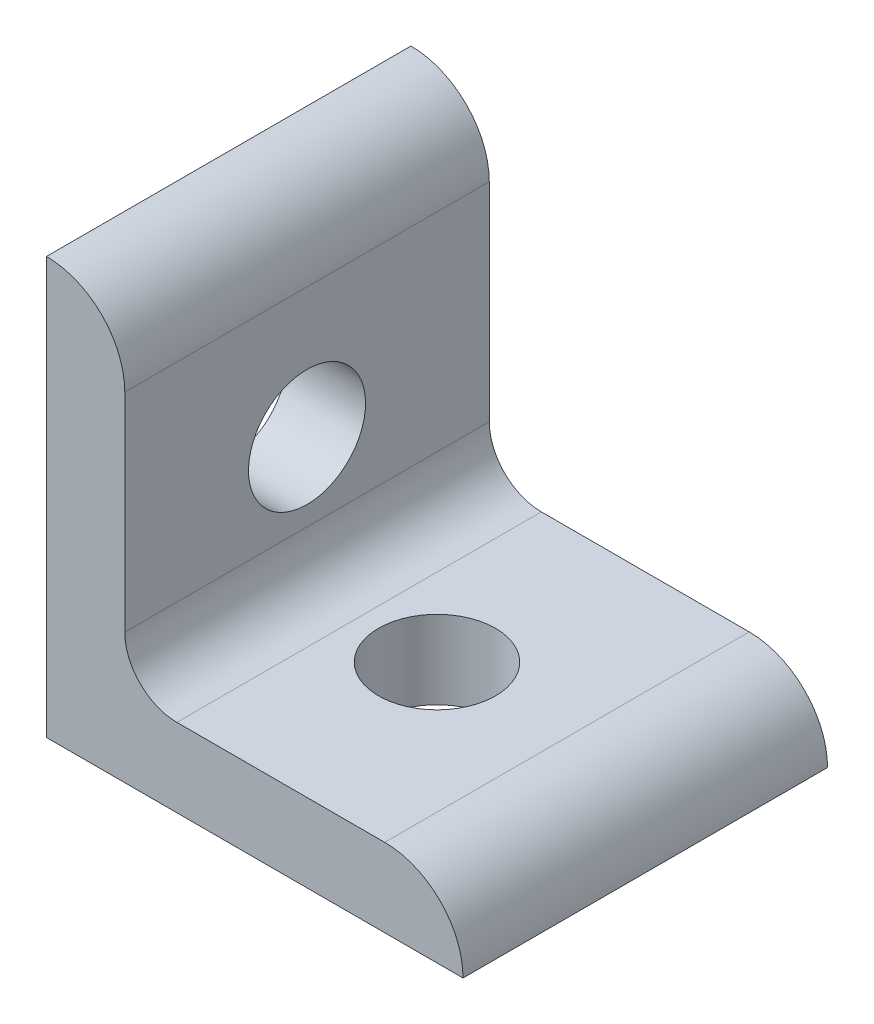
ISO-10303-21;
HEADER;
FILE_DESCRIPTION(('STEP AP214'),'2;1');
FILE_NAME('part.step','',(''),(''),'','','');
FILE_SCHEMA(('AUTOMOTIVE_DESIGN { 1 0 10303 214 1 1 1 1 }'));
ENDSEC;
DATA;
#1=APPLICATION_CONTEXT('core data for automotive mechanical design processes');
#2=APPLICATION_PROTOCOL_DEFINITION('international standard','automotive_design',2000,#1);
#3=PRODUCT_CONTEXT('',#1,'mechanical');
#4=PRODUCT('Part','Part','',(#3));
#5=PRODUCT_RELATED_PRODUCT_CATEGORY('part','',(#4));
#6=PRODUCT_DEFINITION_FORMATION('','',#4);
#7=PRODUCT_DEFINITION_CONTEXT('part definition',#1,'design');
#8=PRODUCT_DEFINITION('design','',#6,#7);
#9=PRODUCT_DEFINITION_SHAPE('','',#8);
#10=(LENGTH_UNIT() NAMED_UNIT(*) SI_UNIT(.MILLI.,.METRE.));
#11=(NAMED_UNIT(*) PLANE_ANGLE_UNIT() SI_UNIT($,.RADIAN.));
#12=(NAMED_UNIT(*) SI_UNIT($,.STERADIAN.) SOLID_ANGLE_UNIT());
#13=UNCERTAINTY_MEASURE_WITH_UNIT(LENGTH_MEASURE(1.E-05),#10,'distance_accuracy_value','');
#14=(GEOMETRIC_REPRESENTATION_CONTEXT(3) GLOBAL_UNCERTAINTY_ASSIGNED_CONTEXT((#13)) GLOBAL_UNIT_ASSIGNED_CONTEXT((#10,
#11,#12)) REPRESENTATION_CONTEXT('',''));
#15=CARTESIAN_POINT('',(0.,0.,0.));
#16=DIRECTION('',(0.,0.,1.));
#17=DIRECTION('',(1.,0.,0.));
#18=AXIS2_PLACEMENT_3D('',#15,#16,#17);
#19=CARTESIAN_POINT('',(4.7752,20.6248,11.1125));
#20=DIRECTION('',(-1.,0.,0.));
#21=DIRECTION('',(0.,-1.,0.));
#22=AXIS2_PLACEMENT_3D('',#19,#20,#21);
#23=PLANE('',#22);
#24=DIRECTION('',(0.,1.,0.));
#25=VECTOR('',#24,1.);
#26=CARTESIAN_POINT('',(4.7752,20.6248,-11.1125));
#27=LINE('',#26,#25);
#28=CARTESIAN_POINT('',(4.7752,7.9502,-11.1125));
#29=VERTEX_POINT('',#28);
#30=CARTESIAN_POINT('',(4.7752,20.6248,-11.1125));
#31=VERTEX_POINT('',#30);
#32=EDGE_CURVE('E116',#29,#31,#27,.T.);
#33=ORIENTED_EDGE('',*,*,#32,.T.);
#34=DIRECTION('',(0.,0.,-1.));
#35=VECTOR('',#34,1.);
#36=CARTESIAN_POINT('',(4.7752,20.6248,11.1125));
#37=LINE('',#36,#35);
#38=CARTESIAN_POINT('',(4.7752,20.6248,11.1125));
#39=VERTEX_POINT('',#38);
#40=EDGE_CURVE('E113',#39,#31,#37,.T.);
#41=ORIENTED_EDGE('',*,*,#40,.F.);
#42=DIRECTION('',(0.,1.,0.));
#43=VECTOR('',#42,1.);
#44=CARTESIAN_POINT('',(4.7752,20.6248,11.1125));
#45=LINE('',#44,#43);
#46=CARTESIAN_POINT('',(4.7752,7.9502,11.1125));
#47=VERTEX_POINT('',#46);
#48=EDGE_CURVE('E102',#47,#39,#45,.T.);
#49=ORIENTED_EDGE('',*,*,#48,.F.);
#50=DIRECTION('',(0.,0.,-1.));
#51=VECTOR('',#50,1.);
#52=CARTESIAN_POINT('',(4.7752,7.9502,11.1125));
#53=LINE('',#52,#51);
#54=EDGE_CURVE('E117',#47,#29,#53,.T.);
#55=ORIENTED_EDGE('',*,*,#54,.T.);
#56=EDGE_LOOP('',(#33,#41,#49,#55));
#57=FACE_BOUND('',#56,.T.);
#58=CARTESIAN_POINT('',(4.7752,12.7,0.));
#59=DIRECTION('',(-1.,0.,0.));
#60=DIRECTION('',(0.,-1.,0.));
#61=AXIS2_PLACEMENT_3D('',#58,#59,#60);
#62=CIRCLE('',#61,3.5687);
#63=CARTESIAN_POINT('',(4.7752,9.1313,0.));
#64=VERTEX_POINT('',#63);
#65=EDGE_CURVE('E166',#64,#64,#62,.F.);
#66=ORIENTED_EDGE('',*,*,#65,.F.);
#67=EDGE_LOOP('',(#66));
#68=FACE_BOUND('',#67,.T.);
#69=ADVANCED_FACE('F34',(#57,#68),#23,.F.);
#70=CARTESIAN_POINT('',(0.,0.,11.1125));
#71=DIRECTION('',(1.,0.,0.));
#72=DIRECTION('',(0.,0.,-1.));
#73=AXIS2_PLACEMENT_3D('',#70,#71,#72);
#74=PLANE('',#73);
#75=DIRECTION('',(0.,-1.,0.));
#76=VECTOR('',#75,1.);
#77=CARTESIAN_POINT('',(0.,0.,-11.1125));
#78=LINE('',#77,#76);
#79=CARTESIAN_POINT('',(0.,25.4,-11.1125));
#80=VERTEX_POINT('',#79);
#81=CARTESIAN_POINT('',(0.,0.,-11.1125));
#82=VERTEX_POINT('',#81);
#83=EDGE_CURVE('E84',#80,#82,#78,.T.);
#84=ORIENTED_EDGE('',*,*,#83,.T.);
#85=DIRECTION('',(0.,0.,-1.));
#86=VECTOR('',#85,1.);
#87=CARTESIAN_POINT('',(0.,0.,11.1125));
#88=LINE('',#87,#86);
#89=CARTESIAN_POINT('',(0.,0.,11.1125));
#90=VERTEX_POINT('',#89);
#91=EDGE_CURVE('E122',#90,#82,#88,.T.);
#92=ORIENTED_EDGE('',*,*,#91,.F.);
#93=DIRECTION('',(0.,-1.,0.));
#94=VECTOR('',#93,1.);
#95=CARTESIAN_POINT('',(0.,0.,11.1125));
#96=LINE('',#95,#94);
#97=CARTESIAN_POINT('',(0.,25.4,11.1125));
#98=VERTEX_POINT('',#97);
#99=EDGE_CURVE('E52',#98,#90,#96,.T.);
#100=ORIENTED_EDGE('',*,*,#99,.F.);
#101=DIRECTION('',(0.,0.,-1.));
#102=VECTOR('',#101,1.);
#103=CARTESIAN_POINT('',(0.,25.4,11.1125));
#104=LINE('',#103,#102);
#105=EDGE_CURVE('E118',#98,#80,#104,.T.);
#106=ORIENTED_EDGE('',*,*,#105,.T.);
#107=EDGE_LOOP('',(#84,#92,#100,#106));
#108=FACE_BOUND('',#107,.T.);
#109=CARTESIAN_POINT('',(0.,12.7,0.));
#110=DIRECTION('',(1.,0.,0.));
#111=DIRECTION('',(0.,0.,-1.));
#112=AXIS2_PLACEMENT_3D('',#109,#110,#111);
#113=CIRCLE('',#112,3.5687);
#114=CARTESIAN_POINT('',(0.,12.7,-3.5687));
#115=VERTEX_POINT('',#114);
#116=EDGE_CURVE('E169',#115,#115,#113,.T.);
#117=ORIENTED_EDGE('',*,*,#116,.T.);
#118=EDGE_LOOP('',(#117));
#119=FACE_BOUND('',#118,.T.);
#120=ADVANCED_FACE('F173',(#108,#119),#74,.F.);
#121=CARTESIAN_POINT('',(25.4,0.,11.1125));
#122=DIRECTION('',(0.,1.,0.));
#123=DIRECTION('',(-1.,0.,0.));
#124=AXIS2_PLACEMENT_3D('',#121,#122,#123);
#125=PLANE('',#124);
#126=DIRECTION('',(1.,0.,0.));
#127=VECTOR('',#126,1.);
#128=CARTESIAN_POINT('',(25.4,0.,-11.1125));
#129=LINE('',#128,#127);
#130=CARTESIAN_POINT('',(25.4,0.,-11.1125));
#131=VERTEX_POINT('',#130);
#132=EDGE_CURVE('E126',#82,#131,#129,.T.);
#133=ORIENTED_EDGE('',*,*,#132,.T.);
#134=DIRECTION('',(0.,0.,-1.));
#135=VECTOR('',#134,1.);
#136=CARTESIAN_POINT('',(25.4,0.,11.1125));
#137=LINE('',#136,#135);
#138=CARTESIAN_POINT('',(25.4,0.,11.1125));
#139=VERTEX_POINT('',#138);
#140=EDGE_CURVE('E11',#139,#131,#137,.T.);
#141=ORIENTED_EDGE('',*,*,#140,.F.);
#142=DIRECTION('',(1.,0.,0.));
#143=VECTOR('',#142,1.);
#144=CARTESIAN_POINT('',(25.4,0.,11.1125));
#145=LINE('',#144,#143);
#146=EDGE_CURVE('E138',#90,#139,#145,.T.);
#147=ORIENTED_EDGE('',*,*,#146,.F.);
#148=ORIENTED_EDGE('',*,*,#91,.T.);
#149=EDGE_LOOP('',(#133,#141,#147,#148));
#150=FACE_BOUND('',#149,.T.);
#151=CARTESIAN_POINT('',(12.7,0.,0.));
#152=DIRECTION('',(0.,1.,0.));
#153=DIRECTION('',(0.,0.,1.));
#154=AXIS2_PLACEMENT_3D('',#151,#152,#153);
#155=CIRCLE('',#154,3.5687);
#156=CARTESIAN_POINT('',(12.7,0.,3.5687));
#157=VERTEX_POINT('',#156);
#158=EDGE_CURVE('E163',#157,#157,#155,.T.);
#159=ORIENTED_EDGE('',*,*,#158,.T.);
#160=EDGE_LOOP('',(#159));
#161=FACE_BOUND('',#160,.T.);
#162=ADVANCED_FACE('F36',(#150,#161),#125,.F.);
#163=CARTESIAN_POINT('',(7.9502,4.7752,11.1125));
#164=DIRECTION('',(0.,-1.,0.));
#165=DIRECTION('',(0.,0.,-1.));
#166=AXIS2_PLACEMENT_3D('',#163,#164,#165);
#167=PLANE('',#166);
#168=DIRECTION('',(-1.,0.,0.));
#169=VECTOR('',#168,1.);
#170=CARTESIAN_POINT('',(7.9502,4.7752,-11.1125));
#171=LINE('',#170,#169);
#172=CARTESIAN_POINT('',(20.6248,4.7752,-11.1125));
#173=VERTEX_POINT('',#172);
#174=CARTESIAN_POINT('',(7.9502,4.7752,-11.1125));
#175=VERTEX_POINT('',#174);
#176=EDGE_CURVE('E131',#173,#175,#171,.T.);
#177=ORIENTED_EDGE('',*,*,#176,.T.);
#178=DIRECTION('',(0.,0.,-1.));
#179=VECTOR('',#178,1.);
#180=CARTESIAN_POINT('',(7.9502,4.7752,11.1125));
#181=LINE('',#180,#179);
#182=CARTESIAN_POINT('',(7.9502,4.7752,11.1125));
#183=VERTEX_POINT('',#182);
#184=EDGE_CURVE('E142',#183,#175,#181,.T.);
#185=ORIENTED_EDGE('',*,*,#184,.F.);
#186=DIRECTION('',(-1.,0.,0.));
#187=VECTOR('',#186,1.);
#188=CARTESIAN_POINT('',(7.9502,4.7752,11.1125));
#189=LINE('',#188,#187);
#190=CARTESIAN_POINT('',(20.6248,4.7752,11.1125));
#191=VERTEX_POINT('',#190);
#192=EDGE_CURVE('E152',#191,#183,#189,.T.);
#193=ORIENTED_EDGE('',*,*,#192,.F.);
#194=DIRECTION('',(0.,0.,-1.));
#195=VECTOR('',#194,1.);
#196=CARTESIAN_POINT('',(20.6248,4.7752,11.1125));
#197=LINE('',#196,#195);
#198=EDGE_CURVE('E44',#191,#173,#197,.T.);
#199=ORIENTED_EDGE('',*,*,#198,.T.);
#200=EDGE_LOOP('',(#177,#185,#193,#199));
#201=FACE_BOUND('',#200,.T.);
#202=CARTESIAN_POINT('',(12.7,4.7752,0.));
#203=DIRECTION('',(0.,-1.,0.));
#204=DIRECTION('',(0.,0.,-1.));
#205=AXIS2_PLACEMENT_3D('',#202,#203,#204);
#206=CIRCLE('',#205,3.5687);
#207=CARTESIAN_POINT('',(12.7,4.7752,-3.5687));
#208=VERTEX_POINT('',#207);
#209=EDGE_CURVE('E38',#208,#208,#206,.F.);
#210=ORIENTED_EDGE('',*,*,#209,.F.);
#211=EDGE_LOOP('',(#210));
#212=FACE_BOUND('',#211,.T.);
#213=ADVANCED_FACE('F149',(#201,#212),#167,.F.);
#214=CARTESIAN_POINT('',(20.6248,0.,11.1125));
#215=DIRECTION('',(0.,0.,-1.));
#216=DIRECTION('',(-1.,0.,0.));
#217=AXIS2_PLACEMENT_3D('',#214,#215,#216);
#218=CYLINDRICAL_SURFACE('',#217,4.7752);
#219=CARTESIAN_POINT('',(20.6248,0.,-11.1125));
#220=DIRECTION('',(0.,0.,1.));
#221=DIRECTION('',(1.,0.,0.));
#222=AXIS2_PLACEMENT_3D('',#219,#220,#221);
#223=CIRCLE('',#222,4.7752);
#224=EDGE_CURVE('E129',#131,#173,#223,.T.);
#225=ORIENTED_EDGE('',*,*,#224,.T.);
#226=ORIENTED_EDGE('',*,*,#198,.F.);
#227=CARTESIAN_POINT('',(20.6248,0.,11.1125));
#228=DIRECTION('',(0.,0.,1.));
#229=DIRECTION('',(1.,0.,0.));
#230=AXIS2_PLACEMENT_3D('',#227,#228,#229);
#231=CIRCLE('',#230,4.7752);
#232=EDGE_CURVE('E92',#139,#191,#231,.T.);
#233=ORIENTED_EDGE('',*,*,#232,.F.);
#234=ORIENTED_EDGE('',*,*,#140,.T.);
#235=EDGE_LOOP('',(#225,#226,#233,#234));
#236=FACE_BOUND('',#235,.T.);
#237=ADVANCED_FACE('F191',(#236),#218,.T.);
#238=CARTESIAN_POINT('',(7.9502,7.9502,11.1125));
#239=DIRECTION('',(0.,0.,-1.));
#240=DIRECTION('',(-1.,0.,0.));
#241=AXIS2_PLACEMENT_3D('',#238,#239,#240);
#242=CYLINDRICAL_SURFACE('',#241,3.175);
#243=CARTESIAN_POINT('',(7.9502,7.9502,-11.1125));
#244=DIRECTION('',(0.,0.,-1.));
#245=DIRECTION('',(1.,0.,0.));
#246=AXIS2_PLACEMENT_3D('',#243,#244,#245);
#247=CIRCLE('',#246,3.175);
#248=EDGE_CURVE('E133',#175,#29,#247,.T.);
#249=ORIENTED_EDGE('',*,*,#248,.T.);
#250=ORIENTED_EDGE('',*,*,#54,.F.);
#251=CARTESIAN_POINT('',(7.9502,7.9502,11.1125));
#252=DIRECTION('',(0.,0.,-1.));
#253=DIRECTION('',(1.,0.,0.));
#254=AXIS2_PLACEMENT_3D('',#251,#252,#253);
#255=CIRCLE('',#254,3.175);
#256=EDGE_CURVE('E108',#183,#47,#255,.T.);
#257=ORIENTED_EDGE('',*,*,#256,.F.);
#258=ORIENTED_EDGE('',*,*,#184,.T.);
#259=EDGE_LOOP('',(#249,#250,#257,#258));
#260=FACE_BOUND('',#259,.T.);
#261=ADVANCED_FACE('F158',(#260),#242,.F.);
#262=CARTESIAN_POINT('',(0.,20.6248,11.1125));
#263=DIRECTION('',(0.,0.,-1.));
#264=DIRECTION('',(-1.,0.,0.));
#265=AXIS2_PLACEMENT_3D('',#262,#263,#264);
#266=CYLINDRICAL_SURFACE('',#265,4.7752);
#267=CARTESIAN_POINT('',(0.,20.6248,-11.1125));
#268=DIRECTION('',(0.,0.,1.));
#269=DIRECTION('',(1.,0.,0.));
#270=AXIS2_PLACEMENT_3D('',#267,#268,#269);
#271=CIRCLE('',#270,4.7752);
#272=EDGE_CURVE('E78',#31,#80,#271,.T.);
#273=ORIENTED_EDGE('',*,*,#272,.T.);
#274=ORIENTED_EDGE('',*,*,#105,.F.);
#275=CARTESIAN_POINT('',(0.,20.6248,11.1125));
#276=DIRECTION('',(0.,0.,1.));
#277=DIRECTION('',(1.,0.,0.));
#278=AXIS2_PLACEMENT_3D('',#275,#276,#277);
#279=CIRCLE('',#278,4.7752);
#280=EDGE_CURVE('E106',#39,#98,#279,.T.);
#281=ORIENTED_EDGE('',*,*,#280,.F.);
#282=ORIENTED_EDGE('',*,*,#40,.T.);
#283=EDGE_LOOP('',(#273,#274,#281,#282));
#284=FACE_BOUND('',#283,.T.);
#285=ADVANCED_FACE('F120',(#284),#266,.T.);
#286=CARTESIAN_POINT('',(0.,20.6248,11.1125));
#287=DIRECTION('',(0.,0.,1.));
#288=DIRECTION('',(1.,0.,0.));
#289=AXIS2_PLACEMENT_3D('',#286,#287,#288);
#290=PLANE('',#289);
#291=ORIENTED_EDGE('',*,*,#146,.T.);
#292=ORIENTED_EDGE('',*,*,#232,.T.);
#293=ORIENTED_EDGE('',*,*,#192,.T.);
#294=ORIENTED_EDGE('',*,*,#256,.T.);
#295=ORIENTED_EDGE('',*,*,#48,.T.);
#296=ORIENTED_EDGE('',*,*,#280,.T.);
#297=ORIENTED_EDGE('',*,*,#99,.T.);
#298=EDGE_LOOP('',(#291,#292,#293,#294,#295,#296,#297));
#299=FACE_BOUND('',#298,.T.);
#300=ADVANCED_FACE('F104',(#299),#290,.T.);
#301=CARTESIAN_POINT('',(0.,20.6248,-11.1125));
#302=DIRECTION('',(0.,0.,1.));
#303=DIRECTION('',(1.,0.,0.));
#304=AXIS2_PLACEMENT_3D('',#301,#302,#303);
#305=PLANE('',#304);
#306=ORIENTED_EDGE('',*,*,#132,.F.);
#307=ORIENTED_EDGE('',*,*,#83,.F.);
#308=ORIENTED_EDGE('',*,*,#272,.F.);
#309=ORIENTED_EDGE('',*,*,#32,.F.);
#310=ORIENTED_EDGE('',*,*,#248,.F.);
#311=ORIENTED_EDGE('',*,*,#176,.F.);
#312=ORIENTED_EDGE('',*,*,#224,.F.);
#313=EDGE_LOOP('',(#306,#307,#308,#309,#310,#311,#312));
#314=FACE_BOUND('',#313,.T.);
#315=ADVANCED_FACE('F156',(#314),#305,.F.);
#316=CARTESIAN_POINT('',(12.7,25.4,0.));
#317=DIRECTION('',(0.,-1.,0.));
#318=DIRECTION('',(0.,0.,-1.));
#319=AXIS2_PLACEMENT_3D('',#316,#317,#318);
#320=CYLINDRICAL_SURFACE('',#319,3.5687);
#321=ORIENTED_EDGE('',*,*,#158,.F.);
#322=EDGE_LOOP('',(#321));
#323=FACE_BOUND('',#322,.T.);
#324=ORIENTED_EDGE('',*,*,#209,.T.);
#325=EDGE_LOOP('',(#324));
#326=FACE_BOUND('',#325,.T.);
#327=ADVANCED_FACE('F178',(#323,#326),#320,.F.);
#328=CARTESIAN_POINT('',(25.4,12.7,0.));
#329=DIRECTION('',(-1.,0.,0.));
#330=DIRECTION('',(0.,0.,1.));
#331=AXIS2_PLACEMENT_3D('',#328,#329,#330);
#332=CYLINDRICAL_SURFACE('',#331,3.5687);
#333=ORIENTED_EDGE('',*,*,#116,.F.);
#334=EDGE_LOOP('',(#333));
#335=FACE_BOUND('',#334,.T.);
#336=ORIENTED_EDGE('',*,*,#65,.T.);
#337=EDGE_LOOP('',(#336));
#338=FACE_BOUND('',#337,.T.);
#339=ADVANCED_FACE('F175',(#335,#338),#332,.F.);
#340=CLOSED_SHELL('',(#69,#120,#162,#213,#237,#261,#285,#300,#315,#327,#339));
#341=MANIFOLD_SOLID_BREP('B2',#340);
#342=ADVANCED_BREP_SHAPE_REPRESENTATION('',(#18,#341),#14);
#343=SHAPE_DEFINITION_REPRESENTATION(#9,#342);
ENDSEC;
END-ISO-10303-21;
